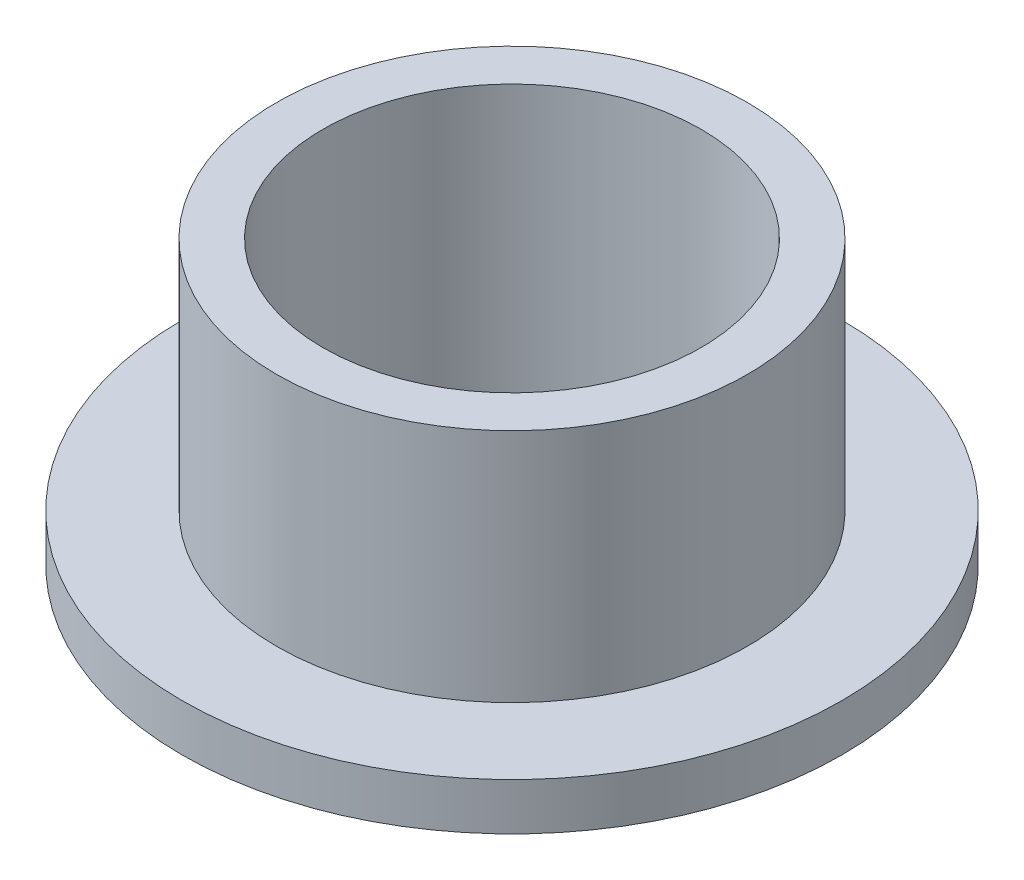
ISO-10303-21;
HEADER;
FILE_DESCRIPTION(('STEP AP214'),'2;1');
FILE_NAME('part.step','',(''),(''),'','','');
FILE_SCHEMA(('AUTOMOTIVE_DESIGN { 1 0 10303 214 1 1 1 1 }'));
ENDSEC;
DATA;
#1=APPLICATION_CONTEXT('core data for automotive mechanical design processes');
#2=APPLICATION_PROTOCOL_DEFINITION('international standard','automotive_design',2000,#1);
#3=PRODUCT_CONTEXT('',#1,'mechanical');
#4=PRODUCT('Part','Part','',(#3));
#5=PRODUCT_RELATED_PRODUCT_CATEGORY('part','',(#4));
#6=PRODUCT_DEFINITION_FORMATION('','',#4);
#7=PRODUCT_DEFINITION_CONTEXT('part definition',#1,'design');
#8=PRODUCT_DEFINITION('design','',#6,#7);
#9=PRODUCT_DEFINITION_SHAPE('','',#8);
#10=(LENGTH_UNIT() NAMED_UNIT(*) SI_UNIT(.MILLI.,.METRE.));
#11=(NAMED_UNIT(*) PLANE_ANGLE_UNIT() SI_UNIT($,.RADIAN.));
#12=(NAMED_UNIT(*) SI_UNIT($,.STERADIAN.) SOLID_ANGLE_UNIT());
#13=UNCERTAINTY_MEASURE_WITH_UNIT(LENGTH_MEASURE(1.E-05),#10,'distance_accuracy_value','');
#14=(GEOMETRIC_REPRESENTATION_CONTEXT(3) GLOBAL_UNCERTAINTY_ASSIGNED_CONTEXT((#13)) GLOBAL_UNIT_ASSIGNED_CONTEXT((#10,
#11,#12)) REPRESENTATION_CONTEXT('',''));
#15=CARTESIAN_POINT('',(0.,0.,0.));
#16=DIRECTION('',(0.,0.,1.));
#17=DIRECTION('',(1.,0.,0.));
#18=AXIS2_PLACEMENT_3D('',#15,#16,#17);
#19=CARTESIAN_POINT('',(0.,9.525,0.));
#20=DIRECTION('',(0.,1.,0.));
#21=DIRECTION('',(0.,0.,1.));
#22=AXIS2_PLACEMENT_3D('',#19,#20,#21);
#23=PLANE('',#22);
#24=CARTESIAN_POINT('',(0.,9.525,0.));
#25=DIRECTION('',(0.,1.,0.));
#26=DIRECTION('',(0.,0.,1.));
#27=AXIS2_PLACEMENT_3D('',#24,#25,#26);
#28=CIRCLE('',#27,7.9375);
#29=CARTESIAN_POINT('',(0.,9.525,7.9375));
#30=VERTEX_POINT('',#29);
#31=EDGE_CURVE('E10',#30,#30,#28,.T.);
#32=ORIENTED_EDGE('',*,*,#31,.T.);
#33=EDGE_LOOP('',(#32));
#34=FACE_BOUND('',#33,.T.);
#35=CARTESIAN_POINT('',(0.,9.525,0.));
#36=DIRECTION('',(0.,1.,0.));
#37=DIRECTION('',(0.,0.,1.));
#38=AXIS2_PLACEMENT_3D('',#35,#36,#37);
#39=CIRCLE('',#38,6.3754);
#40=CARTESIAN_POINT('',(0.,9.525,6.3754));
#41=VERTEX_POINT('',#40);
#42=EDGE_CURVE('E44',#41,#41,#39,.T.);
#43=ORIENTED_EDGE('',*,*,#42,.F.);
#44=EDGE_LOOP('',(#43));
#45=FACE_BOUND('',#44,.T.);
#46=ADVANCED_FACE('F36',(#34,#45),#23,.T.);
#47=CARTESIAN_POINT('',(0.,0.,0.));
#48=DIRECTION('',(0.,1.,0.));
#49=DIRECTION('',(0.,0.,1.));
#50=AXIS2_PLACEMENT_3D('',#47,#48,#49);
#51=PLANE('',#50);
#52=CARTESIAN_POINT('',(0.,0.,0.));
#53=DIRECTION('',(0.,1.,0.));
#54=DIRECTION('',(0.,0.,1.));
#55=AXIS2_PLACEMENT_3D('',#52,#53,#54);
#56=CIRCLE('',#55,6.3754);
#57=CARTESIAN_POINT('',(0.,0.,6.3754));
#58=VERTEX_POINT('',#57);
#59=EDGE_CURVE('E49',#58,#58,#56,.T.);
#60=ORIENTED_EDGE('',*,*,#59,.T.);
#61=EDGE_LOOP('',(#60));
#62=FACE_BOUND('',#61,.T.);
#63=CARTESIAN_POINT('',(0.,0.,0.));
#64=DIRECTION('',(0.,1.,0.));
#65=DIRECTION('',(0.,0.,1.));
#66=AXIS2_PLACEMENT_3D('',#63,#64,#65);
#67=CIRCLE('',#66,11.1125);
#68=CARTESIAN_POINT('',(0.,0.,11.1125));
#69=VERTEX_POINT('',#68);
#70=EDGE_CURVE('E58',#69,#69,#67,.T.);
#71=ORIENTED_EDGE('',*,*,#70,.F.);
#72=EDGE_LOOP('',(#71));
#73=FACE_BOUND('',#72,.T.);
#74=ADVANCED_FACE('F85',(#62,#73),#51,.F.);
#75=CARTESIAN_POINT('',(0.,9.525,0.));
#76=DIRECTION('',(0.,-1.,0.));
#77=DIRECTION('',(0.,0.,-1.));
#78=AXIS2_PLACEMENT_3D('',#75,#76,#77);
#79=CYLINDRICAL_SURFACE('',#78,7.9375);
#80=CARTESIAN_POINT('',(0.,1.5875,0.));
#81=DIRECTION('',(0.,1.,0.));
#82=DIRECTION('',(0.,0.,1.));
#83=AXIS2_PLACEMENT_3D('',#80,#81,#82);
#84=CIRCLE('',#83,7.9375);
#85=CARTESIAN_POINT('',(0.,1.5875,7.9375));
#86=VERTEX_POINT('',#85);
#87=EDGE_CURVE('E62',#86,#86,#84,.T.);
#88=ORIENTED_EDGE('',*,*,#87,.T.);
#89=EDGE_LOOP('',(#88));
#90=FACE_BOUND('',#89,.T.);
#91=ORIENTED_EDGE('',*,*,#31,.F.);
#92=EDGE_LOOP('',(#91));
#93=FACE_BOUND('',#92,.T.);
#94=ADVANCED_FACE('F38',(#90,#93),#79,.T.);
#95=CARTESIAN_POINT('',(0.,9.525,0.));
#96=DIRECTION('',(0.,-1.,0.));
#97=DIRECTION('',(0.,0.,-1.));
#98=AXIS2_PLACEMENT_3D('',#95,#96,#97);
#99=CYLINDRICAL_SURFACE('',#98,6.3754);
#100=ORIENTED_EDGE('',*,*,#42,.T.);
#101=EDGE_LOOP('',(#100));
#102=FACE_BOUND('',#101,.T.);
#103=ORIENTED_EDGE('',*,*,#59,.F.);
#104=EDGE_LOOP('',(#103));
#105=FACE_BOUND('',#104,.T.);
#106=ADVANCED_FACE('F74',(#102,#105),#99,.F.);
#107=CARTESIAN_POINT('',(0.,1.5875,0.));
#108=DIRECTION('',(0.,1.,0.));
#109=DIRECTION('',(0.,0.,1.));
#110=AXIS2_PLACEMENT_3D('',#107,#108,#109);
#111=PLANE('',#110);
#112=CARTESIAN_POINT('',(0.,1.5875,0.));
#113=DIRECTION('',(0.,1.,0.));
#114=DIRECTION('',(0.,0.,1.));
#115=AXIS2_PLACEMENT_3D('',#112,#113,#114);
#116=CIRCLE('',#115,11.1125);
#117=CARTESIAN_POINT('',(0.,1.5875,11.1125));
#118=VERTEX_POINT('',#117);
#119=EDGE_CURVE('E56',#118,#118,#116,.T.);
#120=ORIENTED_EDGE('',*,*,#119,.T.);
#121=EDGE_LOOP('',(#120));
#122=FACE_BOUND('',#121,.T.);
#123=ORIENTED_EDGE('',*,*,#87,.F.);
#124=EDGE_LOOP('',(#123));
#125=FACE_BOUND('',#124,.T.);
#126=ADVANCED_FACE('F71',(#122,#125),#111,.T.);
#127=CARTESIAN_POINT('',(0.,1.5875,0.));
#128=DIRECTION('',(0.,-1.,0.));
#129=DIRECTION('',(0.,0.,-1.));
#130=AXIS2_PLACEMENT_3D('',#127,#128,#129);
#131=CYLINDRICAL_SURFACE('',#130,11.1125);
#132=ORIENTED_EDGE('',*,*,#119,.F.);
#133=EDGE_LOOP('',(#132));
#134=FACE_BOUND('',#133,.T.);
#135=ORIENTED_EDGE('',*,*,#70,.T.);
#136=EDGE_LOOP('',(#135));
#137=FACE_BOUND('',#136,.T.);
#138=ADVANCED_FACE('F73',(#134,#137),#131,.T.);
#139=CLOSED_SHELL('',(#46,#74,#94,#106,#126,#138));
#140=MANIFOLD_SOLID_BREP('B2',#139);
#141=ADVANCED_BREP_SHAPE_REPRESENTATION('',(#18,#140),#14);
#142=SHAPE_DEFINITION_REPRESENTATION(#9,#141);
ENDSEC;
END-ISO-10303-21;
